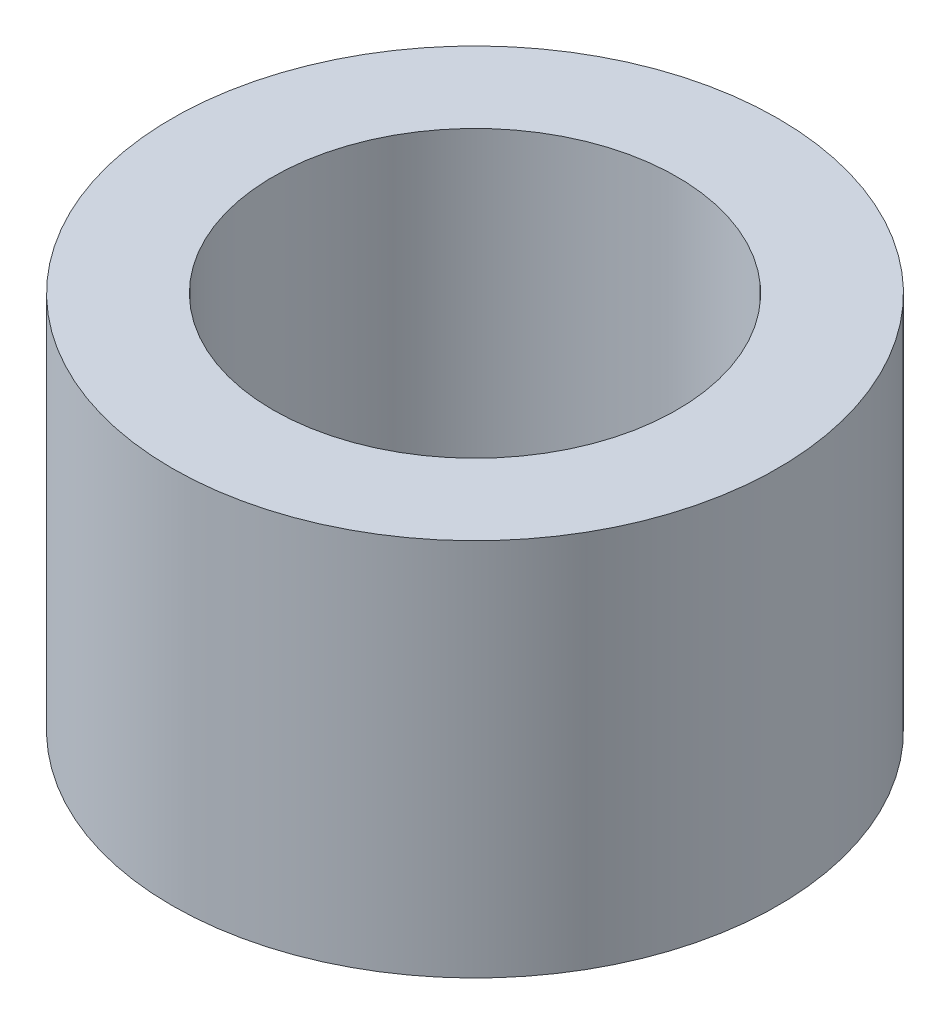
ISO-10303-21;
HEADER;
FILE_DESCRIPTION(('STEP AP214'),'2;1');
FILE_NAME('part.step','',(''),(''),'','','');
FILE_SCHEMA(('AUTOMOTIVE_DESIGN { 1 0 10303 214 1 1 1 1 }'));
ENDSEC;
DATA;
#1=APPLICATION_CONTEXT('core data for automotive mechanical design processes');
#2=APPLICATION_PROTOCOL_DEFINITION('international standard','automotive_design',2000,#1);
#3=PRODUCT_CONTEXT('',#1,'mechanical');
#4=PRODUCT('Part','Part','',(#3));
#5=PRODUCT_RELATED_PRODUCT_CATEGORY('part','',(#4));
#6=PRODUCT_DEFINITION_FORMATION('','',#4);
#7=PRODUCT_DEFINITION_CONTEXT('part definition',#1,'design');
#8=PRODUCT_DEFINITION('design','',#6,#7);
#9=PRODUCT_DEFINITION_SHAPE('','',#8);
#10=(LENGTH_UNIT() NAMED_UNIT(*) SI_UNIT(.MILLI.,.METRE.));
#11=(NAMED_UNIT(*) PLANE_ANGLE_UNIT() SI_UNIT($,.RADIAN.));
#12=(NAMED_UNIT(*) SI_UNIT($,.STERADIAN.) SOLID_ANGLE_UNIT());
#13=UNCERTAINTY_MEASURE_WITH_UNIT(LENGTH_MEASURE(1.E-05),#10,'distance_accuracy_value','');
#14=(GEOMETRIC_REPRESENTATION_CONTEXT(3) GLOBAL_UNCERTAINTY_ASSIGNED_CONTEXT((#13)) GLOBAL_UNIT_ASSIGNED_CONTEXT((#10,
#11,#12)) REPRESENTATION_CONTEXT('',''));
#15=CARTESIAN_POINT('',(0.,0.,0.));
#16=DIRECTION('',(0.,0.,1.));
#17=DIRECTION('',(1.,0.,0.));
#18=AXIS2_PLACEMENT_3D('',#15,#16,#17);
#19=CARTESIAN_POINT('',(0.,7.5,0.));
#20=DIRECTION('',(0.,1.,0.));
#21=DIRECTION('',(0.,0.,1.));
#22=AXIS2_PLACEMENT_3D('',#19,#20,#21);
#23=PLANE('',#22);
#24=CARTESIAN_POINT('',(0.,7.5,0.));
#25=DIRECTION('',(0.,1.,0.));
#26=DIRECTION('',(0.,0.,1.));
#27=AXIS2_PLACEMENT_3D('',#24,#25,#26);
#28=CIRCLE('',#27,6.);
#29=CARTESIAN_POINT('',(0.,7.5,6.));
#30=VERTEX_POINT('',#29);
#31=EDGE_CURVE('E10',#30,#30,#28,.T.);
#32=ORIENTED_EDGE('',*,*,#31,.T.);
#33=EDGE_LOOP('',(#32));
#34=FACE_BOUND('',#33,.T.);
#35=CARTESIAN_POINT('',(0.,7.5,0.));
#36=DIRECTION('',(0.,1.,0.));
#37=DIRECTION('',(0.,0.,1.));
#38=AXIS2_PLACEMENT_3D('',#35,#36,#37);
#39=CIRCLE('',#38,4.);
#40=CARTESIAN_POINT('',(0.,7.5,4.));
#41=VERTEX_POINT('',#40);
#42=EDGE_CURVE('E42',#41,#41,#39,.T.);
#43=ORIENTED_EDGE('',*,*,#42,.F.);
#44=EDGE_LOOP('',(#43));
#45=FACE_BOUND('',#44,.T.);
#46=ADVANCED_FACE('F31',(#34,#45),#23,.T.);
#47=CARTESIAN_POINT('',(0.,0.,0.));
#48=DIRECTION('',(0.,1.,0.));
#49=DIRECTION('',(0.,0.,1.));
#50=AXIS2_PLACEMENT_3D('',#47,#48,#49);
#51=PLANE('',#50);
#52=CARTESIAN_POINT('',(0.,0.,0.));
#53=DIRECTION('',(0.,1.,0.));
#54=DIRECTION('',(0.,0.,1.));
#55=AXIS2_PLACEMENT_3D('',#52,#53,#54);
#56=CIRCLE('',#55,6.);
#57=CARTESIAN_POINT('',(0.,0.,6.));
#58=VERTEX_POINT('',#57);
#59=EDGE_CURVE('E35',#58,#58,#56,.T.);
#60=ORIENTED_EDGE('',*,*,#59,.F.);
#61=EDGE_LOOP('',(#60));
#62=FACE_BOUND('',#61,.T.);
#63=CARTESIAN_POINT('',(0.,0.,0.));
#64=DIRECTION('',(0.,1.,0.));
#65=DIRECTION('',(0.,0.,1.));
#66=AXIS2_PLACEMENT_3D('',#63,#64,#65);
#67=CIRCLE('',#66,4.);
#68=CARTESIAN_POINT('',(0.,0.,4.));
#69=VERTEX_POINT('',#68);
#70=EDGE_CURVE('E44',#69,#69,#67,.T.);
#71=ORIENTED_EDGE('',*,*,#70,.T.);
#72=EDGE_LOOP('',(#71));
#73=FACE_BOUND('',#72,.T.);
#74=ADVANCED_FACE('F54',(#62,#73),#51,.F.);
#75=CARTESIAN_POINT('',(0.,7.5,0.));
#76=DIRECTION('',(0.,-1.,0.));
#77=DIRECTION('',(0.,0.,-1.));
#78=AXIS2_PLACEMENT_3D('',#75,#76,#77);
#79=CYLINDRICAL_SURFACE('',#78,6.);
#80=ORIENTED_EDGE('',*,*,#31,.F.);
#81=EDGE_LOOP('',(#80));
#82=FACE_BOUND('',#81,.T.);
#83=ORIENTED_EDGE('',*,*,#59,.T.);
#84=EDGE_LOOP('',(#83));
#85=FACE_BOUND('',#84,.T.);
#86=ADVANCED_FACE('F33',(#82,#85),#79,.T.);
#87=CARTESIAN_POINT('',(0.,7.5,0.));
#88=DIRECTION('',(0.,-1.,0.));
#89=DIRECTION('',(0.,0.,-1.));
#90=AXIS2_PLACEMENT_3D('',#87,#88,#89);
#91=CYLINDRICAL_SURFACE('',#90,4.);
#92=ORIENTED_EDGE('',*,*,#42,.T.);
#93=EDGE_LOOP('',(#92));
#94=FACE_BOUND('',#93,.T.);
#95=ORIENTED_EDGE('',*,*,#70,.F.);
#96=EDGE_LOOP('',(#95));
#97=FACE_BOUND('',#96,.T.);
#98=ADVANCED_FACE('F50',(#94,#97),#91,.F.);
#99=CLOSED_SHELL('',(#46,#74,#86,#98));
#100=MANIFOLD_SOLID_BREP('B2',#99);
#101=ADVANCED_BREP_SHAPE_REPRESENTATION('',(#18,#100),#14);
#102=SHAPE_DEFINITION_REPRESENTATION(#9,#101);
ENDSEC;
END-ISO-10303-21;
